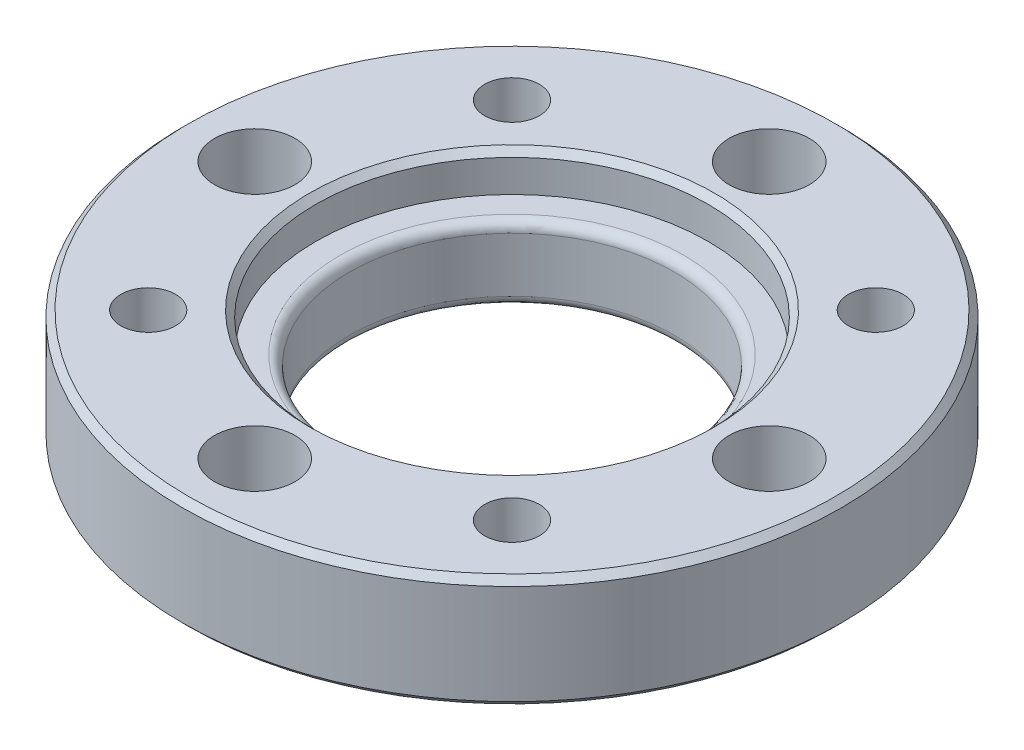
ISO-10303-21;
HEADER;
FILE_DESCRIPTION(('STEP AP214'),'2;1');
FILE_NAME('part.step','',(''),(''),'','','');
FILE_SCHEMA(('AUTOMOTIVE_DESIGN { 1 0 10303 214 1 1 1 1 }'));
ENDSEC;
DATA;
#1=APPLICATION_CONTEXT('core data for automotive mechanical design processes');
#2=APPLICATION_PROTOCOL_DEFINITION('international standard','automotive_design',2000,#1);
#3=PRODUCT_CONTEXT('',#1,'mechanical');
#4=PRODUCT('Part','Part','',(#3));
#5=PRODUCT_RELATED_PRODUCT_CATEGORY('part','',(#4));
#6=PRODUCT_DEFINITION_FORMATION('','',#4);
#7=PRODUCT_DEFINITION_CONTEXT('part definition',#1,'design');
#8=PRODUCT_DEFINITION('design','',#6,#7);
#9=PRODUCT_DEFINITION_SHAPE('','',#8);
#10=(LENGTH_UNIT() NAMED_UNIT(*) SI_UNIT(.MILLI.,.METRE.));
#11=(NAMED_UNIT(*) PLANE_ANGLE_UNIT() SI_UNIT($,.RADIAN.));
#12=(NAMED_UNIT(*) SI_UNIT($,.STERADIAN.) SOLID_ANGLE_UNIT());
#13=UNCERTAINTY_MEASURE_WITH_UNIT(LENGTH_MEASURE(1.E-05),#10,'distance_accuracy_value','');
#14=(GEOMETRIC_REPRESENTATION_CONTEXT(3) GLOBAL_UNCERTAINTY_ASSIGNED_CONTEXT((#13)) GLOBAL_UNIT_ASSIGNED_CONTEXT((#10,
#11,#12)) REPRESENTATION_CONTEXT('',''));
#15=CARTESIAN_POINT('',(0.,0.,0.));
#16=DIRECTION('',(0.,0.,1.));
#17=DIRECTION('',(1.,0.,0.));
#18=AXIS2_PLACEMENT_3D('',#15,#16,#17);
#19=CARTESIAN_POINT('',(5.656854249492,0.,5.656854249492));
#20=DIRECTION('',(0.,1.,0.));
#21=DIRECTION('',(-1.,0.,0.));
#22=AXIS2_PLACEMENT_3D('',#19,#20,#21);
#23=CYLINDRICAL_SURFACE('',#22,0.85);
#24=CARTESIAN_POINT('',(5.656854249492,-3.5,5.656854249492));
#25=DIRECTION('',(0.,1.,0.));
#26=DIRECTION('',(-1.,0.,0.));
#27=AXIS2_PLACEMENT_3D('',#24,#25,#26);
#28=CIRCLE('',#27,0.85);
#29=CARTESIAN_POINT('',(6.506854249492,-3.5,5.656854249492));
#30=VERTEX_POINT('',#29);
#31=EDGE_CURVE('E174',#30,#30,#28,.T.);
#32=ORIENTED_EDGE('',*,*,#31,.F.);
#33=DIRECTION('',(0.,1.,0.));
#34=VECTOR('',#33,1.);
#35=CARTESIAN_POINT('',(6.506854249492,0.,5.656854249492));
#36=LINE('',#35,#34);
#37=CARTESIAN_POINT('',(6.506854249492,0.,5.656854249492));
#38=VERTEX_POINT('',#37);
#39=EDGE_CURVE('E11',#30,#38,#36,.T.);
#40=ORIENTED_EDGE('',*,*,#39,.T.);
#41=CARTESIAN_POINT('',(5.656854249492,0.,5.656854249492));
#42=DIRECTION('',(0.,1.,0.));
#43=DIRECTION('',(-1.,0.,0.));
#44=AXIS2_PLACEMENT_3D('',#41,#42,#43);
#45=CIRCLE('',#44,0.85);
#46=EDGE_CURVE('E341',#38,#38,#45,.T.);
#47=ORIENTED_EDGE('',*,*,#46,.T.);
#48=ORIENTED_EDGE('',*,*,#39,.F.);
#49=EDGE_LOOP('',(#32,#40,#47,#48));
#50=FACE_BOUND('',#49,.T.);
#51=ADVANCED_FACE('F16',(#50),#23,.F.);
#52=CARTESIAN_POINT('',(5.656854249492,0.,-5.656854249492));
#53=DIRECTION('',(0.,1.,0.));
#54=DIRECTION('',(0.,0.,1.));
#55=AXIS2_PLACEMENT_3D('',#52,#53,#54);
#56=CYLINDRICAL_SURFACE('',#55,0.85);
#57=CARTESIAN_POINT('',(5.656854249492,-3.5,-5.656854249492));
#58=DIRECTION('',(0.,1.,0.));
#59=DIRECTION('',(0.,0.,1.));
#60=AXIS2_PLACEMENT_3D('',#57,#58,#59);
#61=CIRCLE('',#60,0.85);
#62=CARTESIAN_POINT('',(5.656854249492,-3.5,-6.506854249492));
#63=VERTEX_POINT('',#62);
#64=EDGE_CURVE('E184',#63,#63,#61,.T.);
#65=ORIENTED_EDGE('',*,*,#64,.F.);
#66=DIRECTION('',(0.,1.,0.));
#67=VECTOR('',#66,1.);
#68=CARTESIAN_POINT('',(5.656854249492,0.,-6.506854249492));
#69=LINE('',#68,#67);
#70=CARTESIAN_POINT('',(5.656854249492,0.,-6.506854249492));
#71=VERTEX_POINT('',#70);
#72=EDGE_CURVE('E24',#63,#71,#69,.T.);
#73=ORIENTED_EDGE('',*,*,#72,.T.);
#74=CARTESIAN_POINT('',(5.656854249492,0.,-5.656854249492));
#75=DIRECTION('',(0.,1.,0.));
#76=DIRECTION('',(0.,0.,1.));
#77=AXIS2_PLACEMENT_3D('',#74,#75,#76);
#78=CIRCLE('',#77,0.85);
#79=EDGE_CURVE('E271',#71,#71,#78,.T.);
#80=ORIENTED_EDGE('',*,*,#79,.T.);
#81=ORIENTED_EDGE('',*,*,#72,.F.);
#82=EDGE_LOOP('',(#65,#73,#80,#81));
#83=FACE_BOUND('',#82,.T.);
#84=ADVANCED_FACE('F460',(#83),#56,.F.);
#85=CARTESIAN_POINT('',(-5.656854249492,0.,-5.656854249492));
#86=DIRECTION('',(0.,1.,0.));
#87=DIRECTION('',(1.,0.,0.));
#88=AXIS2_PLACEMENT_3D('',#85,#86,#87);
#89=CYLINDRICAL_SURFACE('',#88,0.85);
#90=CARTESIAN_POINT('',(-5.656854249492,-3.5,-5.656854249492));
#91=DIRECTION('',(0.,1.,0.));
#92=DIRECTION('',(1.,0.,0.));
#93=AXIS2_PLACEMENT_3D('',#90,#91,#92);
#94=CIRCLE('',#93,0.85);
#95=CARTESIAN_POINT('',(-6.506854249492,-3.5,-5.656854249492));
#96=VERTEX_POINT('',#95);
#97=EDGE_CURVE('E205',#96,#96,#94,.T.);
#98=ORIENTED_EDGE('',*,*,#97,.F.);
#99=DIRECTION('',(0.,1.,0.));
#100=VECTOR('',#99,1.);
#101=CARTESIAN_POINT('',(-6.506854249492,0.,-5.656854249492));
#102=LINE('',#101,#100);
#103=CARTESIAN_POINT('',(-6.506854249492,0.,-5.656854249492));
#104=VERTEX_POINT('',#103);
#105=EDGE_CURVE('E218',#96,#104,#102,.T.);
#106=ORIENTED_EDGE('',*,*,#105,.T.);
#107=CARTESIAN_POINT('',(-5.656854249492,0.,-5.656854249492));
#108=DIRECTION('',(0.,1.,0.));
#109=DIRECTION('',(1.,0.,0.));
#110=AXIS2_PLACEMENT_3D('',#107,#108,#109);
#111=CIRCLE('',#110,0.85);
#112=EDGE_CURVE('E269',#104,#104,#111,.T.);
#113=ORIENTED_EDGE('',*,*,#112,.T.);
#114=ORIENTED_EDGE('',*,*,#105,.F.);
#115=EDGE_LOOP('',(#98,#106,#113,#114));
#116=FACE_BOUND('',#115,.T.);
#117=ADVANCED_FACE('F464',(#116),#89,.F.);
#118=CARTESIAN_POINT('',(-5.656854249492,0.,5.656854249492));
#119=DIRECTION('',(0.,1.,0.));
#120=DIRECTION('',(0.,0.,-1.));
#121=AXIS2_PLACEMENT_3D('',#118,#119,#120);
#122=CYLINDRICAL_SURFACE('',#121,0.85);
#123=CARTESIAN_POINT('',(-5.656854249492,-3.5,5.656854249492));
#124=DIRECTION('',(0.,1.,0.));
#125=DIRECTION('',(0.,0.,-1.));
#126=AXIS2_PLACEMENT_3D('',#123,#124,#125);
#127=CIRCLE('',#126,0.85);
#128=CARTESIAN_POINT('',(-5.656854249492,-3.5,6.506854249492));
#129=VERTEX_POINT('',#128);
#130=EDGE_CURVE('E201',#129,#129,#127,.T.);
#131=ORIENTED_EDGE('',*,*,#130,.F.);
#132=DIRECTION('',(0.,1.,0.));
#133=VECTOR('',#132,1.);
#134=CARTESIAN_POINT('',(-5.656854249492,0.,6.506854249492));
#135=LINE('',#134,#133);
#136=CARTESIAN_POINT('',(-5.656854249492,0.,6.506854249492));
#137=VERTEX_POINT('',#136);
#138=EDGE_CURVE('E251',#129,#137,#135,.T.);
#139=ORIENTED_EDGE('',*,*,#138,.T.);
#140=CARTESIAN_POINT('',(-5.656854249492,0.,5.656854249492));
#141=DIRECTION('',(0.,1.,0.));
#142=DIRECTION('',(0.,0.,-1.));
#143=AXIS2_PLACEMENT_3D('',#140,#141,#142);
#144=CIRCLE('',#143,0.85);
#145=EDGE_CURVE('E267',#137,#137,#144,.T.);
#146=ORIENTED_EDGE('',*,*,#145,.T.);
#147=ORIENTED_EDGE('',*,*,#138,.F.);
#148=EDGE_LOOP('',(#131,#139,#146,#147));
#149=FACE_BOUND('',#148,.T.);
#150=ADVANCED_FACE('F470',(#149),#122,.F.);
#151=CARTESIAN_POINT('',(0.,-0.1000000001244,0.));
#152=DIRECTION('',(0.,1.,0.));
#153=DIRECTION('',(0.,0.,-1.));
#154=AXIS2_PLACEMENT_3D('',#151,#152,#153);
#155=CONICAL_SURFACE('',#154,6.199999999876,0.785398163397448);
#156=CARTESIAN_POINT('',(0.,-0.2,0.));
#157=DIRECTION('',(0.,-1.,0.));
#158=DIRECTION('',(0.,0.,1.));
#159=AXIS2_PLACEMENT_3D('',#156,#157,#158);
#160=CIRCLE('',#159,6.1);
#161=CARTESIAN_POINT('',(0.,-0.2,6.1));
#162=VERTEX_POINT('',#161);
#163=EDGE_CURVE('E247',#162,#162,#160,.T.);
#164=ORIENTED_EDGE('',*,*,#163,.T.);
#165=DIRECTION('',(0.,0.707106781186548,0.707106781186548));
#166=VECTOR('',#165,1.);
#167=CARTESIAN_POINT('',(0.,-0.1000000001244,6.199999999876));
#168=LINE('',#167,#166);
#169=CARTESIAN_POINT('',(0.,-1.88026677561126E-13,6.30000000000021));
#170=VERTEX_POINT('',#169);
#171=EDGE_CURVE('E36',#162,#170,#168,.T.);
#172=ORIENTED_EDGE('',*,*,#171,.T.);
#173=CARTESIAN_POINT('',(0.,0.,0.));
#174=DIRECTION('',(0.,-1.,0.));
#175=DIRECTION('',(0.,0.,-1.));
#176=AXIS2_PLACEMENT_3D('',#173,#174,#175);
#177=CIRCLE('',#176,6.3);
#178=EDGE_CURVE('E277',#170,#170,#177,.T.);
#179=ORIENTED_EDGE('',*,*,#178,.F.);
#180=ORIENTED_EDGE('',*,*,#171,.F.);
#181=EDGE_LOOP('',(#164,#172,#179,#180));
#182=FACE_BOUND('',#181,.T.);
#183=ADVANCED_FACE('F478',(#182),#155,.F.);
#184=CARTESIAN_POINT('',(0.,0.,0.));
#185=DIRECTION('',(0.,1.,0.));
#186=DIRECTION('',(0.,0.,-1.));
#187=AXIS2_PLACEMENT_3D('',#184,#185,#186);
#188=CYLINDRICAL_SURFACE('',#187,6.1);
#189=CARTESIAN_POINT('',(0.,-1.2,0.));
#190=DIRECTION('',(0.,1.,0.));
#191=DIRECTION('',(0.,0.,-1.));
#192=AXIS2_PLACEMENT_3D('',#189,#190,#191);
#193=CIRCLE('',#192,6.1);
#194=CARTESIAN_POINT('',(0.,-1.2,6.1));
#195=VERTEX_POINT('',#194);
#196=EDGE_CURVE('E241',#195,#195,#193,.T.);
#197=ORIENTED_EDGE('',*,*,#196,.F.);
#198=DIRECTION('',(0.,1.,0.));
#199=VECTOR('',#198,1.);
#200=CARTESIAN_POINT('',(0.,0.,6.1));
#201=LINE('',#200,#199);
#202=EDGE_CURVE('E45',#195,#162,#201,.T.);
#203=ORIENTED_EDGE('',*,*,#202,.T.);
#204=ORIENTED_EDGE('',*,*,#163,.F.);
#205=ORIENTED_EDGE('',*,*,#202,.F.);
#206=EDGE_LOOP('',(#197,#203,#204,#205));
#207=FACE_BOUND('',#206,.T.);
#208=ADVANCED_FACE('F474',(#207),#188,.F.);
#209=CARTESIAN_POINT('',(0.,-1.2,0.));
#210=DIRECTION('',(0.,1.,0.));
#211=DIRECTION('',(1.,0.,0.));
#212=AXIS2_PLACEMENT_3D('',#209,#210,#211);
#213=PLANE('',#212);
#214=CARTESIAN_POINT('',(0.,-1.2,0.));
#215=DIRECTION('',(0.,1.,0.));
#216=DIRECTION('',(1.,0.,0.));
#217=AXIS2_PLACEMENT_3D('',#214,#215,#216);
#218=CIRCLE('',#217,5.35);
#219=CARTESIAN_POINT('',(-5.3498044851379,-1.2,-0.0457380672789792));
#220=VERTEX_POINT('',#219);
#221=EDGE_CURVE('E242',#220,#220,#218,.T.);
#222=ORIENTED_EDGE('',*,*,#221,.F.);
#223=EDGE_LOOP('',(#222));
#224=FACE_BOUND('',#223,.T.);
#225=ORIENTED_EDGE('',*,*,#196,.T.);
#226=EDGE_LOOP('',(#225));
#227=FACE_BOUND('',#226,.T.);
#228=ADVANCED_FACE('F477',(#224,#227),#213,.T.);
#229=CARTESIAN_POINT('',(0.,-1.5,0.));
#230=DIRECTION('',(0.,-1.,0.));
#231=DIRECTION('',(0.999963455165962,0.,0.00854917145401467));
#232=AXIS2_PLACEMENT_3D('',#229,#230,#231);
#233=TOROIDAL_SURFACE('',#232,5.35,0.3);
#234=ORIENTED_EDGE('',*,*,#221,.T.);
#235=CARTESIAN_POINT('',(-5.3498044851379,-1.5,-0.0457380672789792));
#236=DIRECTION('',(0.0085491714540148,0.,-0.999963455165962));
#237=DIRECTION('',(-0.999963455165962,0.,-0.0085491714540148));
#238=AXIS2_PLACEMENT_3D('',#235,#236,#237);
#239=CIRCLE('',#238,0.3);
#240=CARTESIAN_POINT('',(-5.04981544858811,-1.5,-0.0431733158427747));
#241=VERTEX_POINT('',#240);
#242=EDGE_CURVE('E238',#220,#241,#239,.T.);
#243=ORIENTED_EDGE('',*,*,#242,.T.);
#244=CARTESIAN_POINT('',(0.,-1.5,0.));
#245=DIRECTION('',(0.,1.,0.));
#246=DIRECTION('',(-1.,0.,0.));
#247=AXIS2_PLACEMENT_3D('',#244,#245,#246);
#248=CIRCLE('',#247,5.05);
#249=CARTESIAN_POINT('',(5.05,-1.5,0.));
#250=VERTEX_POINT('',#249);
#251=EDGE_CURVE('E229',#250,#241,#248,.T.);
#252=ORIENTED_EDGE('',*,*,#251,.F.);
#253=CARTESIAN_POINT('',(0.,-1.5,0.));
#254=DIRECTION('',(0.,1.,0.));
#255=DIRECTION('',(-1.,0.,0.));
#256=AXIS2_PLACEMENT_3D('',#253,#254,#255);
#257=CIRCLE('',#256,5.05);
#258=EDGE_CURVE('E233',#241,#250,#257,.T.);
#259=ORIENTED_EDGE('',*,*,#258,.F.);
#260=ORIENTED_EDGE('',*,*,#242,.F.);
#261=EDGE_LOOP('',(#234,#243,#252,#259,#260));
#262=FACE_BOUND('',#261,.T.);
#263=ADVANCED_FACE('F488',(#262),#233,.T.);
#264=CARTESIAN_POINT('',(0.,0.175,0.));
#265=DIRECTION('',(0.,-1.,0.));
#266=DIRECTION('',(-1.,0.,0.));
#267=AXIS2_PLACEMENT_3D('',#264,#265,#266);
#268=CYLINDRICAL_SURFACE('',#267,5.05);
#269=ORIENTED_EDGE('',*,*,#251,.T.);
#270=ORIENTED_EDGE('',*,*,#258,.T.);
#271=DIRECTION('',(0.,-1.,0.));
#272=VECTOR('',#271,1.);
#273=CARTESIAN_POINT('',(5.05,0.175,0.));
#274=LINE('',#273,#272);
#275=CARTESIAN_POINT('',(5.05,-3.2,0.));
#276=VERTEX_POINT('',#275);
#277=EDGE_CURVE('E237',#250,#276,#274,.T.);
#278=ORIENTED_EDGE('',*,*,#277,.T.);
#279=CARTESIAN_POINT('',(0.,-3.2,0.));
#280=DIRECTION('',(0.,1.,0.));
#281=DIRECTION('',(1.,0.,0.));
#282=AXIS2_PLACEMENT_3D('',#279,#280,#281);
#283=CIRCLE('',#282,5.05);
#284=CARTESIAN_POINT('',(-5.04959718255861,-3.2,-0.0637831787868035));
#285=VERTEX_POINT('',#284);
#286=EDGE_CURVE('E215',#285,#276,#283,.T.);
#287=ORIENTED_EDGE('',*,*,#286,.F.);
#288=CARTESIAN_POINT('',(0.,-3.2,0.));
#289=DIRECTION('',(0.,1.,0.));
#290=DIRECTION('',(1.,0.,0.));
#291=AXIS2_PLACEMENT_3D('',#288,#289,#290);
#292=CIRCLE('',#291,5.05);
#293=EDGE_CURVE('E222',#276,#285,#292,.T.);
#294=ORIENTED_EDGE('',*,*,#293,.F.);
#295=ORIENTED_EDGE('',*,*,#277,.F.);
#296=EDGE_LOOP('',(#269,#270,#278,#287,#294,#295));
#297=FACE_BOUND('',#296,.T.);
#298=ADVANCED_FACE('F454',(#297),#268,.F.);
#299=CARTESIAN_POINT('',(0.,-3.2,0.));
#300=DIRECTION('',(0.,-1.,0.));
#301=DIRECTION('',(0.999920234170022,0.,0.0126303324330303));
#302=AXIS2_PLACEMENT_3D('',#299,#300,#301);
#303=TOROIDAL_SURFACE('',#302,5.35,0.3);
#304=ORIENTED_EDGE('',*,*,#286,.T.);
#305=ORIENTED_EDGE('',*,*,#293,.T.);
#306=CARTESIAN_POINT('',(-5.34957325280962,-3.2,-0.0675722785167126));
#307=DIRECTION('',(0.0126303324330304,0.,-0.999920234170022));
#308=DIRECTION('',(-0.999920234170022,0.,-0.0126303324330304));
#309=AXIS2_PLACEMENT_3D('',#306,#307,#308);
#310=CIRCLE('',#309,0.3);
#311=CARTESIAN_POINT('',(-5.34957325280962,-3.5,-0.0675722785167126));
#312=VERTEX_POINT('',#311);
#313=EDGE_CURVE('E226',#285,#312,#310,.T.);
#314=ORIENTED_EDGE('',*,*,#313,.T.);
#315=CARTESIAN_POINT('',(0.,-3.5,0.));
#316=DIRECTION('',(0.,1.,0.));
#317=DIRECTION('',(1.,0.,0.));
#318=AXIS2_PLACEMENT_3D('',#315,#316,#317);
#319=CIRCLE('',#318,5.35);
#320=EDGE_CURVE('E197',#312,#312,#319,.T.);
#321=ORIENTED_EDGE('',*,*,#320,.F.);
#322=ORIENTED_EDGE('',*,*,#313,.F.);
#323=EDGE_LOOP('',(#304,#305,#314,#321,#322));
#324=FACE_BOUND('',#323,.T.);
#325=ADVANCED_FACE('F445',(#324),#303,.T.);
#326=CARTESIAN_POINT('',(0.,-3.400000000018,0.));
#327=DIRECTION('',(0.,1.,0.));
#328=DIRECTION('',(0.,0.,-1.));
#329=AXIS2_PLACEMENT_3D('',#326,#327,#328);
#330=CONICAL_SURFACE('',#329,10.14999999998,0.785398163397448);
#331=CARTESIAN_POINT('',(0.,-3.3,0.));
#332=DIRECTION('',(0.,1.,0.));
#333=DIRECTION('',(-1.,0.,0.));
#334=AXIS2_PLACEMENT_3D('',#331,#332,#333);
#335=CIRCLE('',#334,10.25);
#336=CARTESIAN_POINT('',(10.24999999998,-3.300000000017,-2.513034247555E-10));
#337=VERTEX_POINT('',#336);
#338=CARTESIAN_POINT('',(0.,-3.299999999999,10.249999999999));
#339=VERTEX_POINT('',#338);
#340=EDGE_CURVE('E307',#337,#339,#335,.T.);
#341=ORIENTED_EDGE('',*,*,#340,.F.);
#342=CARTESIAN_POINT('',(0.,-3.3,0.));
#343=DIRECTION('',(0.,1.,0.));
#344=DIRECTION('',(-1.,0.,0.));
#345=AXIS2_PLACEMENT_3D('',#342,#343,#344);
#346=CIRCLE('',#345,10.25);
#347=EDGE_CURVE('E404',#339,#337,#346,.T.);
#348=ORIENTED_EDGE('',*,*,#347,.F.);
#349=DIRECTION('',(0.,-0.707106781186548,-0.707106781186548));
#350=VECTOR('',#349,1.);
#351=CARTESIAN_POINT('',(0.,-3.400000000018,10.14999999998));
#352=LINE('',#351,#350);
#353=CARTESIAN_POINT('',(0.,-3.499999999999,10.049999999999));
#354=VERTEX_POINT('',#353);
#355=EDGE_CURVE('E212',#339,#354,#352,.T.);
#356=ORIENTED_EDGE('',*,*,#355,.T.);
#357=CARTESIAN_POINT('',(0.,-3.5,0.));
#358=DIRECTION('',(0.,1.,0.));
#359=DIRECTION('',(-1.,0.,0.));
#360=AXIS2_PLACEMENT_3D('',#357,#358,#359);
#361=CIRCLE('',#360,10.05);
#362=EDGE_CURVE('E188',#354,#354,#361,.T.);
#363=ORIENTED_EDGE('',*,*,#362,.T.);
#364=ORIENTED_EDGE('',*,*,#355,.F.);
#365=EDGE_LOOP('',(#341,#348,#356,#363,#364));
#366=FACE_BOUND('',#365,.T.);
#367=ADVANCED_FACE('F443',(#366),#330,.T.);
#368=CARTESIAN_POINT('',(-8.,0.,0.));
#369=DIRECTION('',(0.,-1.,0.));
#370=DIRECTION('',(0.,0.,-1.));
#371=AXIS2_PLACEMENT_3D('',#368,#369,#370);
#372=CYLINDRICAL_SURFACE('',#371,1.25);
#373=CARTESIAN_POINT('',(-8.,0.,0.));
#374=DIRECTION('',(0.,-1.,0.));
#375=DIRECTION('',(0.,0.,-1.));
#376=AXIS2_PLACEMENT_3D('',#373,#374,#375);
#377=CIRCLE('',#376,1.25);
#378=CARTESIAN_POINT('',(-8.,0.,1.25));
#379=VERTEX_POINT('',#378);
#380=EDGE_CURVE('E328',#379,#379,#377,.T.);
#381=ORIENTED_EDGE('',*,*,#380,.F.);
#382=DIRECTION('',(0.,-1.,0.));
#383=VECTOR('',#382,1.);
#384=CARTESIAN_POINT('',(-8.,0.,1.25));
#385=LINE('',#384,#383);
#386=CARTESIAN_POINT('',(-8.,-3.5,1.25));
#387=VERTEX_POINT('',#386);
#388=EDGE_CURVE('E180',#379,#387,#385,.T.);
#389=ORIENTED_EDGE('',*,*,#388,.T.);
#390=CARTESIAN_POINT('',(-8.,-3.5,0.));
#391=DIRECTION('',(0.,-1.,0.));
#392=DIRECTION('',(0.,0.,-1.));
#393=AXIS2_PLACEMENT_3D('',#390,#391,#392);
#394=CIRCLE('',#393,1.25);
#395=EDGE_CURVE('E196',#387,#387,#394,.T.);
#396=ORIENTED_EDGE('',*,*,#395,.T.);
#397=ORIENTED_EDGE('',*,*,#388,.F.);
#398=EDGE_LOOP('',(#381,#389,#396,#397));
#399=FACE_BOUND('',#398,.T.);
#400=ADVANCED_FACE('F287',(#399),#372,.F.);
#401=CARTESIAN_POINT('',(0.,0.,8.));
#402=DIRECTION('',(0.,-1.,0.));
#403=DIRECTION('',(-1.,0.,0.));
#404=AXIS2_PLACEMENT_3D('',#401,#402,#403);
#405=CYLINDRICAL_SURFACE('',#404,1.25);
#406=CARTESIAN_POINT('',(0.,0.,8.));
#407=DIRECTION('',(0.,-1.,0.));
#408=DIRECTION('',(-1.,0.,0.));
#409=AXIS2_PLACEMENT_3D('',#406,#407,#408);
#410=CIRCLE('',#409,1.25);
#411=CARTESIAN_POINT('',(1.25,0.,8.));
#412=VERTEX_POINT('',#411);
#413=EDGE_CURVE('E349',#412,#412,#410,.T.);
#414=ORIENTED_EDGE('',*,*,#413,.F.);
#415=DIRECTION('',(0.,-1.,0.));
#416=VECTOR('',#415,1.);
#417=CARTESIAN_POINT('',(1.25,0.,8.));
#418=LINE('',#417,#416);
#419=CARTESIAN_POINT('',(1.25,-3.5,8.));
#420=VERTEX_POINT('',#419);
#421=EDGE_CURVE('E173',#412,#420,#418,.T.);
#422=ORIENTED_EDGE('',*,*,#421,.T.);
#423=CARTESIAN_POINT('',(0.,-3.5,8.));
#424=DIRECTION('',(0.,-1.,0.));
#425=DIRECTION('',(-1.,0.,0.));
#426=AXIS2_PLACEMENT_3D('',#423,#424,#425);
#427=CIRCLE('',#426,1.25);
#428=EDGE_CURVE('E192',#420,#420,#427,.T.);
#429=ORIENTED_EDGE('',*,*,#428,.T.);
#430=ORIENTED_EDGE('',*,*,#421,.F.);
#431=EDGE_LOOP('',(#414,#422,#429,#430));
#432=FACE_BOUND('',#431,.T.);
#433=ADVANCED_FACE('F452',(#432),#405,.F.);
#434=CARTESIAN_POINT('',(8.,0.,0.));
#435=DIRECTION('',(0.,-1.,0.));
#436=DIRECTION('',(0.,0.,1.));
#437=AXIS2_PLACEMENT_3D('',#434,#435,#436);
#438=CYLINDRICAL_SURFACE('',#437,1.25);
#439=CARTESIAN_POINT('',(8.,0.,0.));
#440=DIRECTION('',(0.,-1.,0.));
#441=DIRECTION('',(0.,0.,1.));
#442=AXIS2_PLACEMENT_3D('',#439,#440,#441);
#443=CIRCLE('',#442,1.25);
#444=CARTESIAN_POINT('',(8.,0.,-1.25));
#445=VERTEX_POINT('',#444);
#446=EDGE_CURVE('E171',#445,#445,#443,.T.);
#447=ORIENTED_EDGE('',*,*,#446,.F.);
#448=DIRECTION('',(0.,-1.,0.));
#449=VECTOR('',#448,1.);
#450=CARTESIAN_POINT('',(8.,0.,-1.25));
#451=LINE('',#450,#449);
#452=CARTESIAN_POINT('',(8.,-3.5,-1.25));
#453=VERTEX_POINT('',#452);
#454=EDGE_CURVE('E166',#445,#453,#451,.T.);
#455=ORIENTED_EDGE('',*,*,#454,.T.);
#456=CARTESIAN_POINT('',(8.,-3.5,0.));
#457=DIRECTION('',(0.,-1.,0.));
#458=DIRECTION('',(0.,0.,1.));
#459=AXIS2_PLACEMENT_3D('',#456,#457,#458);
#460=CIRCLE('',#459,1.25);
#461=EDGE_CURVE('E169',#453,#453,#460,.T.);
#462=ORIENTED_EDGE('',*,*,#461,.T.);
#463=ORIENTED_EDGE('',*,*,#454,.F.);
#464=EDGE_LOOP('',(#447,#455,#462,#463));
#465=FACE_BOUND('',#464,.T.);
#466=ADVANCED_FACE('F167',(#465),#438,.F.);
#467=CARTESIAN_POINT('',(0.,-3.5,0.));
#468=DIRECTION('',(0.,-1.,0.));
#469=DIRECTION('',(0.,0.,-1.));
#470=AXIS2_PLACEMENT_3D('',#467,#468,#469);
#471=PLANE('',#470);
#472=ORIENTED_EDGE('',*,*,#31,.T.);
#473=EDGE_LOOP('',(#472));
#474=FACE_BOUND('',#473,.T.);
#475=ORIENTED_EDGE('',*,*,#64,.T.);
#476=EDGE_LOOP('',(#475));
#477=FACE_BOUND('',#476,.T.);
#478=ORIENTED_EDGE('',*,*,#97,.T.);
#479=EDGE_LOOP('',(#478));
#480=FACE_BOUND('',#479,.T.);
#481=ORIENTED_EDGE('',*,*,#130,.T.);
#482=EDGE_LOOP('',(#481));
#483=FACE_BOUND('',#482,.T.);
#484=ORIENTED_EDGE('',*,*,#320,.T.);
#485=EDGE_LOOP('',(#484));
#486=FACE_BOUND('',#485,.T.);
#487=CARTESIAN_POINT('',(0.,-3.5,-8.));
#488=DIRECTION('',(0.,-1.,0.));
#489=DIRECTION('',(1.,0.,0.));
#490=AXIS2_PLACEMENT_3D('',#487,#488,#489);
#491=CIRCLE('',#490,1.25);
#492=CARTESIAN_POINT('',(-1.25,-3.5,-8.));
#493=VERTEX_POINT('',#492);
#494=EDGE_CURVE('E276',#493,#493,#491,.T.);
#495=ORIENTED_EDGE('',*,*,#494,.F.);
#496=EDGE_LOOP('',(#495));
#497=FACE_BOUND('',#496,.T.);
#498=ORIENTED_EDGE('',*,*,#395,.F.);
#499=EDGE_LOOP('',(#498));
#500=FACE_BOUND('',#499,.T.);
#501=ORIENTED_EDGE('',*,*,#428,.F.);
#502=EDGE_LOOP('',(#501));
#503=FACE_BOUND('',#502,.T.);
#504=ORIENTED_EDGE('',*,*,#461,.F.);
#505=EDGE_LOOP('',(#504));
#506=FACE_BOUND('',#505,.T.);
#507=ORIENTED_EDGE('',*,*,#362,.F.);
#508=EDGE_LOOP('',(#507));
#509=FACE_BOUND('',#508,.T.);
#510=ADVANCED_FACE('F290',(#474,#477,#480,#483,#486,#497,#500,#503,#506,#509),#471,.T.);
#511=CARTESIAN_POINT('',(0.,0.,-8.));
#512=DIRECTION('',(0.,-1.,0.));
#513=DIRECTION('',(1.,0.,0.));
#514=AXIS2_PLACEMENT_3D('',#511,#512,#513);
#515=CYLINDRICAL_SURFACE('',#514,1.25);
#516=CARTESIAN_POINT('',(0.,0.,-8.));
#517=DIRECTION('',(0.,-1.,0.));
#518=DIRECTION('',(1.,0.,0.));
#519=AXIS2_PLACEMENT_3D('',#516,#517,#518);
#520=CIRCLE('',#519,1.25);
#521=CARTESIAN_POINT('',(-1.25,0.,-8.));
#522=VERTEX_POINT('',#521);
#523=EDGE_CURVE('E324',#522,#522,#520,.T.);
#524=ORIENTED_EDGE('',*,*,#523,.F.);
#525=DIRECTION('',(0.,-1.,0.));
#526=VECTOR('',#525,1.);
#527=CARTESIAN_POINT('',(-1.25,0.,-8.));
#528=LINE('',#527,#526);
#529=EDGE_CURVE('E272',#522,#493,#528,.T.);
#530=ORIENTED_EDGE('',*,*,#529,.T.);
#531=ORIENTED_EDGE('',*,*,#494,.T.);
#532=ORIENTED_EDGE('',*,*,#529,.F.);
#533=EDGE_LOOP('',(#524,#530,#531,#532));
#534=FACE_BOUND('',#533,.T.);
#535=ADVANCED_FACE('F293',(#534),#515,.F.);
#536=CARTESIAN_POINT('',(0.,0.,0.));
#537=DIRECTION('',(0.,-1.,0.));
#538=DIRECTION('',(0.,0.,-1.));
#539=AXIS2_PLACEMENT_3D('',#536,#537,#538);
#540=PLANE('',#539);
#541=ORIENTED_EDGE('',*,*,#178,.T.);
#542=EDGE_LOOP('',(#541));
#543=FACE_BOUND('',#542,.T.);
#544=ORIENTED_EDGE('',*,*,#46,.F.);
#545=EDGE_LOOP('',(#544));
#546=FACE_BOUND('',#545,.T.);
#547=ORIENTED_EDGE('',*,*,#79,.F.);
#548=EDGE_LOOP('',(#547));
#549=FACE_BOUND('',#548,.T.);
#550=ORIENTED_EDGE('',*,*,#112,.F.);
#551=EDGE_LOOP('',(#550));
#552=FACE_BOUND('',#551,.T.);
#553=ORIENTED_EDGE('',*,*,#145,.F.);
#554=EDGE_LOOP('',(#553));
#555=FACE_BOUND('',#554,.T.);
#556=ORIENTED_EDGE('',*,*,#523,.T.);
#557=EDGE_LOOP('',(#556));
#558=FACE_BOUND('',#557,.T.);
#559=ORIENTED_EDGE('',*,*,#380,.T.);
#560=EDGE_LOOP('',(#559));
#561=FACE_BOUND('',#560,.T.);
#562=ORIENTED_EDGE('',*,*,#413,.T.);
#563=EDGE_LOOP('',(#562));
#564=FACE_BOUND('',#563,.T.);
#565=ORIENTED_EDGE('',*,*,#446,.T.);
#566=EDGE_LOOP('',(#565));
#567=FACE_BOUND('',#566,.T.);
#568=CARTESIAN_POINT('',(0.,0.,0.));
#569=DIRECTION('',(0.,1.,0.));
#570=DIRECTION('',(-1.,0.,0.));
#571=AXIS2_PLACEMENT_3D('',#568,#569,#570);
#572=CIRCLE('',#571,10.05);
#573=CARTESIAN_POINT('',(0.,1.14540321671797E-12,10.0500000000011));
#574=VERTEX_POINT('',#573);
#575=EDGE_CURVE('E333',#574,#574,#572,.T.);
#576=ORIENTED_EDGE('',*,*,#575,.T.);
#577=EDGE_LOOP('',(#576));
#578=FACE_BOUND('',#577,.T.);
#579=ADVANCED_FACE('F420',(#543,#546,#549,#552,#555,#558,#561,#564,#567,#578),#540,.F.);
#580=CARTESIAN_POINT('',(0.,-0.09999999996771,0.));
#581=DIRECTION('',(0.,-1.,0.));
#582=DIRECTION('',(0.,0.,-1.));
#583=AXIS2_PLACEMENT_3D('',#580,#581,#582);
#584=CONICAL_SURFACE('',#583,10.14999999997,0.785398163397448);
#585=CARTESIAN_POINT('',(0.,-0.2,0.));
#586=DIRECTION('',(0.,1.,0.));
#587=DIRECTION('',(-1.,0.,0.));
#588=AXIS2_PLACEMENT_3D('',#585,#586,#587);
#589=CIRCLE('',#588,10.25);
#590=CARTESIAN_POINT('',(10.25,-0.2,0.));
#591=VERTEX_POINT('',#590);
#592=CARTESIAN_POINT('',(0.,-0.199999999998856,10.2500000000011));
#593=VERTEX_POINT('',#592);
#594=EDGE_CURVE('E313',#591,#593,#589,.T.);
#595=ORIENTED_EDGE('',*,*,#594,.T.);
#596=DIRECTION('',(0.,0.707106781186548,-0.707106781186548));
#597=VECTOR('',#596,1.);
#598=CARTESIAN_POINT('',(0.,-0.09999999996771,10.14999999997));
#599=LINE('',#598,#597);
#600=EDGE_CURVE('E316',#593,#574,#599,.T.);
#601=ORIENTED_EDGE('',*,*,#600,.T.);
#602=ORIENTED_EDGE('',*,*,#575,.F.);
#603=ORIENTED_EDGE('',*,*,#600,.F.);
#604=CARTESIAN_POINT('',(0.,-0.2,0.));
#605=DIRECTION('',(0.,1.,0.));
#606=DIRECTION('',(-1.,0.,0.));
#607=AXIS2_PLACEMENT_3D('',#604,#605,#606);
#608=CIRCLE('',#607,10.25);
#609=EDGE_CURVE('E317',#593,#591,#608,.T.);
#610=ORIENTED_EDGE('',*,*,#609,.T.);
#611=EDGE_LOOP('',(#595,#601,#602,#603,#610));
#612=FACE_BOUND('',#611,.T.);
#613=ADVANCED_FACE('F423',(#612),#584,.T.);
#614=CARTESIAN_POINT('',(0.,0.175,0.));
#615=DIRECTION('',(0.,-1.,0.));
#616=DIRECTION('',(-1.,0.,0.));
#617=AXIS2_PLACEMENT_3D('',#614,#615,#616);
#618=CYLINDRICAL_SURFACE('',#617,10.25);
#619=ORIENTED_EDGE('',*,*,#340,.T.);
#620=ORIENTED_EDGE('',*,*,#347,.T.);
#621=DIRECTION('',(0.,1.,0.));
#622=VECTOR('',#621,1.);
#623=CARTESIAN_POINT('',(10.25,0.175,0.));
#624=LINE('',#623,#622);
#625=EDGE_CURVE('E403',#337,#591,#624,.T.);
#626=ORIENTED_EDGE('',*,*,#625,.T.);
#627=ORIENTED_EDGE('',*,*,#609,.F.);
#628=ORIENTED_EDGE('',*,*,#594,.F.);
#629=ORIENTED_EDGE('',*,*,#625,.F.);
#630=EDGE_LOOP('',(#619,#620,#626,#627,#628,#629));
#631=FACE_BOUND('',#630,.T.);
#632=ADVANCED_FACE('F440',(#631),#618,.T.);
#633=CLOSED_SHELL('',(#51,#84,#117,#150,#183,#208,#228,#263,#298,#325,#367,#400,#433,#466,#510,
#535,#579,#613,#632));
#634=MANIFOLD_SOLID_BREP('B1',#633);
#635=ADVANCED_BREP_SHAPE_REPRESENTATION('',(#18,#634),#14);
#636=SHAPE_DEFINITION_REPRESENTATION(#9,#635);
ENDSEC;
END-ISO-10303-21;
